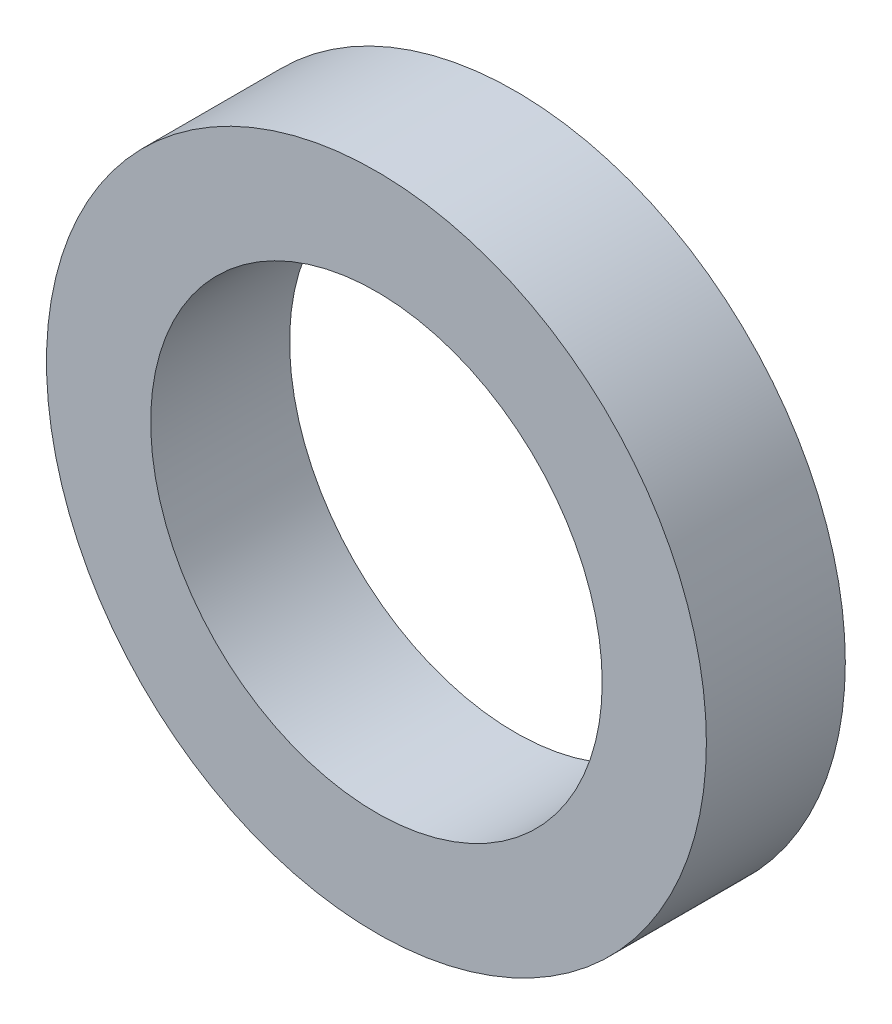
ISO-10303-21;
HEADER;
FILE_DESCRIPTION(('STEP AP214'),'2;1');
FILE_NAME('part.step','',(''),(''),'','','');
FILE_SCHEMA(('AUTOMOTIVE_DESIGN { 1 0 10303 214 1 1 1 1 }'));
ENDSEC;
DATA;
#1=APPLICATION_CONTEXT('core data for automotive mechanical design processes');
#2=APPLICATION_PROTOCOL_DEFINITION('international standard','automotive_design',2000,#1);
#3=PRODUCT_CONTEXT('',#1,'mechanical');
#4=PRODUCT('Part','Part','',(#3));
#5=PRODUCT_RELATED_PRODUCT_CATEGORY('part','',(#4));
#6=PRODUCT_DEFINITION_FORMATION('','',#4);
#7=PRODUCT_DEFINITION_CONTEXT('part definition',#1,'design');
#8=PRODUCT_DEFINITION('design','',#6,#7);
#9=PRODUCT_DEFINITION_SHAPE('','',#8);
#10=(LENGTH_UNIT() NAMED_UNIT(*) SI_UNIT(.MILLI.,.METRE.));
#11=(NAMED_UNIT(*) PLANE_ANGLE_UNIT() SI_UNIT($,.RADIAN.));
#12=(NAMED_UNIT(*) SI_UNIT($,.STERADIAN.) SOLID_ANGLE_UNIT());
#13=UNCERTAINTY_MEASURE_WITH_UNIT(LENGTH_MEASURE(1.E-05),#10,'distance_accuracy_value','');
#14=(GEOMETRIC_REPRESENTATION_CONTEXT(3) GLOBAL_UNCERTAINTY_ASSIGNED_CONTEXT((#13)) GLOBAL_UNIT_ASSIGNED_CONTEXT((#10,
#11,#12)) REPRESENTATION_CONTEXT('',''));
#15=CARTESIAN_POINT('',(0.,0.,0.));
#16=DIRECTION('',(0.,0.,1.));
#17=DIRECTION('',(1.,0.,0.));
#18=AXIS2_PLACEMENT_3D('',#15,#16,#17);
#19=CARTESIAN_POINT('',(0.,0.,-4.));
#20=DIRECTION('',(0.,0.,-1.));
#21=DIRECTION('',(1.,0.,0.));
#22=AXIS2_PLACEMENT_3D('',#19,#20,#21);
#23=PLANE('',#22);
#24=CARTESIAN_POINT('',(0.,0.,-4.));
#25=DIRECTION('',(0.,0.,1.));
#26=DIRECTION('',(1.,0.,0.));
#27=AXIS2_PLACEMENT_3D('',#24,#25,#26);
#28=CIRCLE('',#27,9.5);
#29=CARTESIAN_POINT('',(9.5,0.,-4.));
#30=VERTEX_POINT('',#29);
#31=EDGE_CURVE('E10',#30,#30,#28,.T.);
#32=ORIENTED_EDGE('',*,*,#31,.F.);
#33=EDGE_LOOP('',(#32));
#34=FACE_BOUND('',#33,.T.);
#35=CARTESIAN_POINT('',(0.,0.,-4.));
#36=DIRECTION('',(0.,0.,1.));
#37=DIRECTION('',(1.,0.,0.));
#38=AXIS2_PLACEMENT_3D('',#35,#36,#37);
#39=CIRCLE('',#38,6.5);
#40=CARTESIAN_POINT('',(6.5,0.,-4.));
#41=VERTEX_POINT('',#40);
#42=EDGE_CURVE('E50',#41,#41,#39,.T.);
#43=ORIENTED_EDGE('',*,*,#42,.T.);
#44=EDGE_LOOP('',(#43));
#45=FACE_BOUND('',#44,.T.);
#46=ADVANCED_FACE('F39',(#34,#45),#23,.T.);
#47=CARTESIAN_POINT('',(0.,0.,0.));
#48=DIRECTION('',(0.,0.,-1.));
#49=DIRECTION('',(1.,0.,0.));
#50=AXIS2_PLACEMENT_3D('',#47,#48,#49);
#51=PLANE('',#50);
#52=CARTESIAN_POINT('',(0.,0.,0.));
#53=DIRECTION('',(0.,0.,1.));
#54=DIRECTION('',(1.,0.,0.));
#55=AXIS2_PLACEMENT_3D('',#52,#53,#54);
#56=CIRCLE('',#55,9.5);
#57=CARTESIAN_POINT('',(9.5,0.,0.));
#58=VERTEX_POINT('',#57);
#59=EDGE_CURVE('E43',#58,#58,#56,.T.);
#60=ORIENTED_EDGE('',*,*,#59,.T.);
#61=EDGE_LOOP('',(#60));
#62=FACE_BOUND('',#61,.T.);
#63=CARTESIAN_POINT('',(0.,0.,0.));
#64=DIRECTION('',(0.,0.,1.));
#65=DIRECTION('',(1.,0.,0.));
#66=AXIS2_PLACEMENT_3D('',#63,#64,#65);
#67=CIRCLE('',#66,6.5);
#68=CARTESIAN_POINT('',(6.5,0.,0.));
#69=VERTEX_POINT('',#68);
#70=EDGE_CURVE('E52',#69,#69,#67,.T.);
#71=ORIENTED_EDGE('',*,*,#70,.F.);
#72=EDGE_LOOP('',(#71));
#73=FACE_BOUND('',#72,.T.);
#74=ADVANCED_FACE('F65',(#62,#73),#51,.F.);
#75=CARTESIAN_POINT('',(0.,0.,-4.));
#76=DIRECTION('',(0.,0.,1.));
#77=DIRECTION('',(-1.,0.,0.));
#78=AXIS2_PLACEMENT_3D('',#75,#76,#77);
#79=CYLINDRICAL_SURFACE('',#78,9.5);
#80=ORIENTED_EDGE('',*,*,#31,.T.);
#81=EDGE_LOOP('',(#80));
#82=FACE_BOUND('',#81,.T.);
#83=ORIENTED_EDGE('',*,*,#59,.F.);
#84=EDGE_LOOP('',(#83));
#85=FACE_BOUND('',#84,.T.);
#86=ADVANCED_FACE('F41',(#82,#85),#79,.T.);
#87=CARTESIAN_POINT('',(0.,0.,-4.));
#88=DIRECTION('',(0.,0.,1.));
#89=DIRECTION('',(-1.,0.,0.));
#90=AXIS2_PLACEMENT_3D('',#87,#88,#89);
#91=CYLINDRICAL_SURFACE('',#90,6.5);
#92=ORIENTED_EDGE('',*,*,#42,.F.);
#93=EDGE_LOOP('',(#92));
#94=FACE_BOUND('',#93,.T.);
#95=ORIENTED_EDGE('',*,*,#70,.T.);
#96=EDGE_LOOP('',(#95));
#97=FACE_BOUND('',#96,.T.);
#98=ADVANCED_FACE('F59',(#94,#97),#91,.F.);
#99=CLOSED_SHELL('',(#46,#74,#86,#98));
#100=MANIFOLD_SOLID_BREP('B2',#99);
#101=ADVANCED_BREP_SHAPE_REPRESENTATION('',(#18,#100),#14);
#102=SHAPE_DEFINITION_REPRESENTATION(#9,#101);
ENDSEC;
END-ISO-10303-21;
